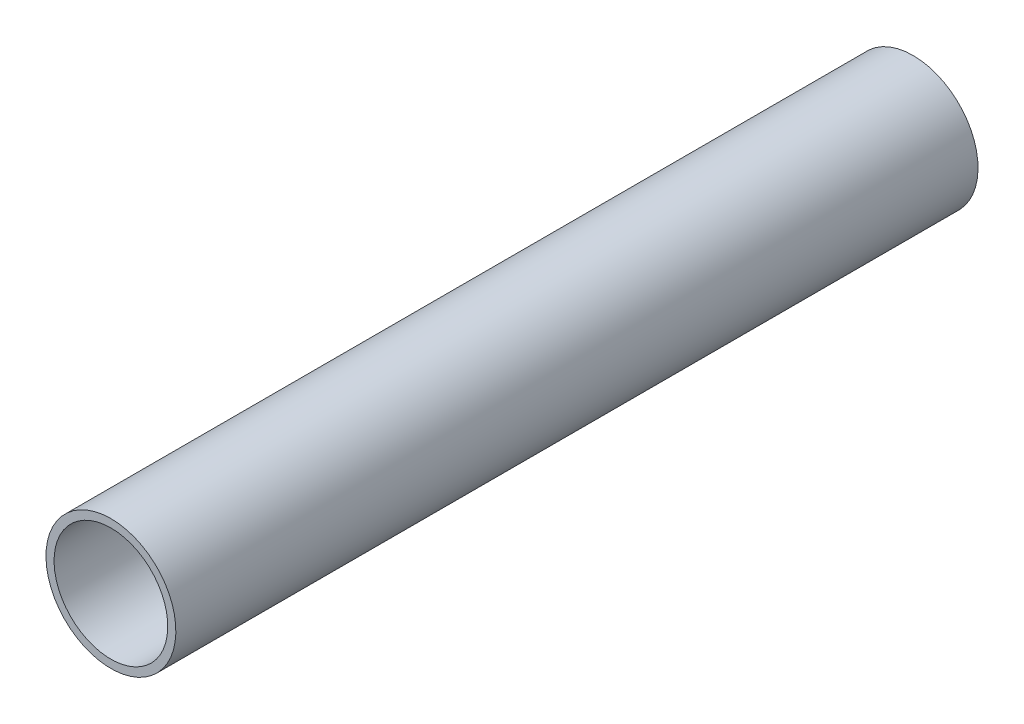
ISO-10303-21;
HEADER;
FILE_DESCRIPTION(('STEP AP214'),'2;1');
FILE_NAME('part.step','',(''),(''),'','','');
FILE_SCHEMA(('AUTOMOTIVE_DESIGN { 1 0 10303 214 1 1 1 1 }'));
ENDSEC;
DATA;
#1=APPLICATION_CONTEXT('core data for automotive mechanical design processes');
#2=APPLICATION_PROTOCOL_DEFINITION('international standard','automotive_design',2000,#1);
#3=PRODUCT_CONTEXT('',#1,'mechanical');
#4=PRODUCT('Part','Part','',(#3));
#5=PRODUCT_RELATED_PRODUCT_CATEGORY('part','',(#4));
#6=PRODUCT_DEFINITION_FORMATION('','',#4);
#7=PRODUCT_DEFINITION_CONTEXT('part definition',#1,'design');
#8=PRODUCT_DEFINITION('design','',#6,#7);
#9=PRODUCT_DEFINITION_SHAPE('','',#8);
#10=(LENGTH_UNIT() NAMED_UNIT(*) SI_UNIT(.MILLI.,.METRE.));
#11=(NAMED_UNIT(*) PLANE_ANGLE_UNIT() SI_UNIT($,.RADIAN.));
#12=(NAMED_UNIT(*) SI_UNIT($,.STERADIAN.) SOLID_ANGLE_UNIT());
#13=UNCERTAINTY_MEASURE_WITH_UNIT(LENGTH_MEASURE(1.E-05),#10,'distance_accuracy_value','');
#14=(GEOMETRIC_REPRESENTATION_CONTEXT(3) GLOBAL_UNCERTAINTY_ASSIGNED_CONTEXT((#13)) GLOBAL_UNIT_ASSIGNED_CONTEXT((#10,
#11,#12)) REPRESENTATION_CONTEXT('',''));
#15=CARTESIAN_POINT('',(0.,0.,0.));
#16=DIRECTION('',(0.,0.,1.));
#17=DIRECTION('',(1.,0.,0.));
#18=AXIS2_PLACEMENT_3D('',#15,#16,#17);
#19=CARTESIAN_POINT('',(0.,141.732,1000.));
#20=DIRECTION('',(0.,0.,1.));
#21=DIRECTION('',(0.,-1.,0.));
#22=AXIS2_PLACEMENT_3D('',#19,#20,#21);
#23=PLANE('',#22);
#24=CARTESIAN_POINT('',(0.,-1.27819932058934E-13,1000.));
#25=DIRECTION('',(0.,0.,-1.));
#26=DIRECTION('',(0.,1.,0.));
#27=AXIS2_PLACEMENT_3D('',#24,#25,#26);
#28=CIRCLE('',#27,141.732);
#29=CARTESIAN_POINT('',(0.,141.732,1000.));
#30=VERTEX_POINT('',#29);
#31=EDGE_CURVE('E46',#30,#30,#28,.T.);
#32=ORIENTED_EDGE('',*,*,#31,.T.);
#33=EDGE_LOOP('',(#32));
#34=FACE_BOUND('',#33,.T.);
#35=CARTESIAN_POINT('',(0.,-1.27819932058934E-13,1000.));
#36=DIRECTION('',(0.,0.,-1.));
#37=DIRECTION('',(0.,1.,0.));
#38=AXIS2_PLACEMENT_3D('',#35,#36,#37);
#39=CIRCLE('',#38,161.925);
#40=CARTESIAN_POINT('',(0.,161.925,1000.));
#41=VERTEX_POINT('',#40);
#42=EDGE_CURVE('E10',#41,#41,#39,.T.);
#43=ORIENTED_EDGE('',*,*,#42,.F.);
#44=EDGE_LOOP('',(#43));
#45=FACE_BOUND('',#44,.T.);
#46=ADVANCED_FACE('F32',(#34,#45),#23,.T.);
#47=CARTESIAN_POINT('',(0.,0.,-17.9701116569837));
#48=DIRECTION('',(0.,0.,-1.));
#49=DIRECTION('',(0.,1.,0.));
#50=AXIS2_PLACEMENT_3D('',#47,#48,#49);
#51=CYLINDRICAL_SURFACE('',#50,161.925);
#52=ORIENTED_EDGE('',*,*,#42,.T.);
#53=EDGE_LOOP('',(#52));
#54=FACE_BOUND('',#53,.T.);
#55=CARTESIAN_POINT('',(0.,1.23307150347989E-13,-1000.));
#56=DIRECTION('',(0.,0.,-1.));
#57=DIRECTION('',(0.,1.,0.));
#58=AXIS2_PLACEMENT_3D('',#55,#56,#57);
#59=CIRCLE('',#58,161.925);
#60=CARTESIAN_POINT('',(0.,161.925,-1000.));
#61=VERTEX_POINT('',#60);
#62=EDGE_CURVE('E38',#61,#61,#59,.T.);
#63=ORIENTED_EDGE('',*,*,#62,.F.);
#64=EDGE_LOOP('',(#63));
#65=FACE_BOUND('',#64,.T.);
#66=ADVANCED_FACE('F62',(#54,#65),#51,.T.);
#67=CARTESIAN_POINT('',(0.,141.732,-1000.));
#68=DIRECTION('',(0.,0.,-1.));
#69=DIRECTION('',(0.,1.,0.));
#70=AXIS2_PLACEMENT_3D('',#67,#68,#69);
#71=PLANE('',#70);
#72=ORIENTED_EDGE('',*,*,#62,.T.);
#73=EDGE_LOOP('',(#72));
#74=FACE_BOUND('',#73,.T.);
#75=CARTESIAN_POINT('',(0.,1.23307150347989E-13,-1000.));
#76=DIRECTION('',(0.,0.,-1.));
#77=DIRECTION('',(0.,1.,0.));
#78=AXIS2_PLACEMENT_3D('',#75,#76,#77);
#79=CIRCLE('',#78,141.732);
#80=CARTESIAN_POINT('',(0.,141.732,-1000.));
#81=VERTEX_POINT('',#80);
#82=EDGE_CURVE('E42',#81,#81,#79,.T.);
#83=ORIENTED_EDGE('',*,*,#82,.F.);
#84=EDGE_LOOP('',(#83));
#85=FACE_BOUND('',#84,.T.);
#86=ADVANCED_FACE('F56',(#74,#85),#71,.T.);
#87=CARTESIAN_POINT('',(0.,0.,-17.9701116569837));
#88=DIRECTION('',(0.,0.,-1.));
#89=DIRECTION('',(0.,1.,0.));
#90=AXIS2_PLACEMENT_3D('',#87,#88,#89);
#91=CYLINDRICAL_SURFACE('',#90,141.732);
#92=ORIENTED_EDGE('',*,*,#82,.T.);
#93=EDGE_LOOP('',(#92));
#94=FACE_BOUND('',#93,.T.);
#95=ORIENTED_EDGE('',*,*,#31,.F.);
#96=EDGE_LOOP('',(#95));
#97=FACE_BOUND('',#96,.T.);
#98=ADVANCED_FACE('F54',(#94,#97),#91,.F.);
#99=CLOSED_SHELL('',(#46,#66,#86,#98));
#100=MANIFOLD_SOLID_BREP('B2',#99);
#101=ADVANCED_BREP_SHAPE_REPRESENTATION('',(#18,#100),#14);
#102=SHAPE_DEFINITION_REPRESENTATION(#9,#101);
ENDSEC;
END-ISO-10303-21;
